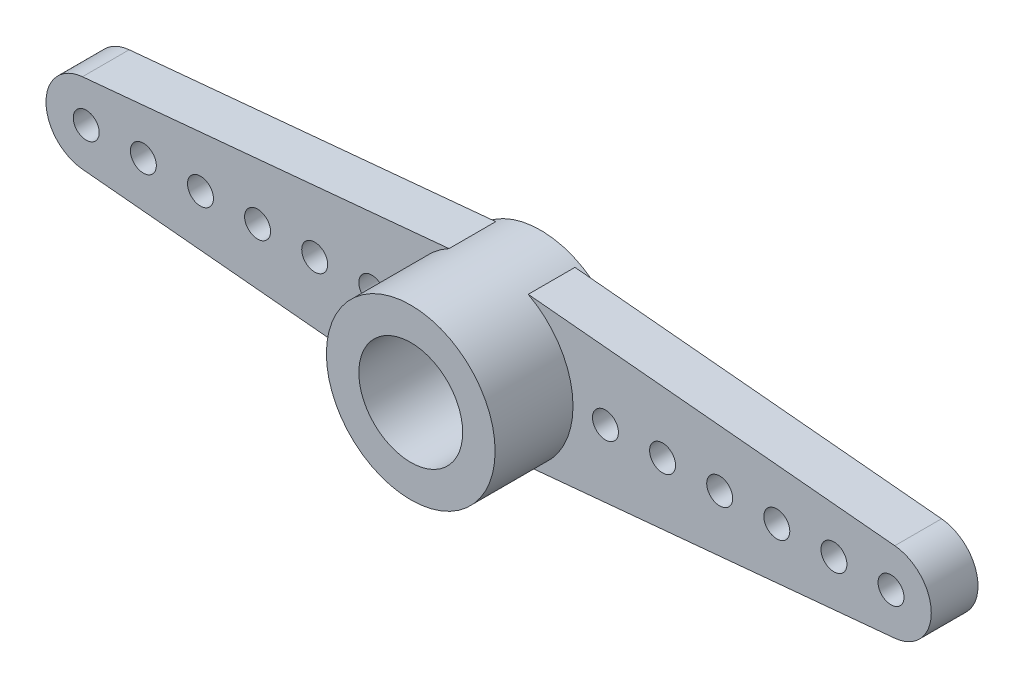
ISO-10303-21;
HEADER;
FILE_DESCRIPTION(('STEP AP214'),'2;1');
FILE_NAME('part.step','',(''),(''),'','','');
FILE_SCHEMA(('AUTOMOTIVE_DESIGN { 1 0 10303 214 1 1 1 1 }'));
ENDSEC;
DATA;
#1=APPLICATION_CONTEXT('core data for automotive mechanical design processes');
#2=APPLICATION_PROTOCOL_DEFINITION('international standard','automotive_design',2000,#1);
#3=PRODUCT_CONTEXT('',#1,'mechanical');
#4=PRODUCT('Part','Part','',(#3));
#5=PRODUCT_RELATED_PRODUCT_CATEGORY('part','',(#4));
#6=PRODUCT_DEFINITION_FORMATION('','',#4);
#7=PRODUCT_DEFINITION_CONTEXT('part definition',#1,'design');
#8=PRODUCT_DEFINITION('design','',#6,#7);
#9=PRODUCT_DEFINITION_SHAPE('','',#8);
#10=(LENGTH_UNIT() NAMED_UNIT(*) SI_UNIT(.MILLI.,.METRE.));
#11=(NAMED_UNIT(*) PLANE_ANGLE_UNIT() SI_UNIT($,.RADIAN.));
#12=(NAMED_UNIT(*) SI_UNIT($,.STERADIAN.) SOLID_ANGLE_UNIT());
#13=UNCERTAINTY_MEASURE_WITH_UNIT(LENGTH_MEASURE(1.E-05),#10,'distance_accuracy_value','');
#14=(GEOMETRIC_REPRESENTATION_CONTEXT(3) GLOBAL_UNCERTAINTY_ASSIGNED_CONTEXT((#13)) GLOBAL_UNIT_ASSIGNED_CONTEXT((#10,
#11,#12)) REPRESENTATION_CONTEXT('',''));
#15=CARTESIAN_POINT('',(0.,0.,0.));
#16=DIRECTION('',(0.,0.,1.));
#17=DIRECTION('',(1.,0.,0.));
#18=AXIS2_PLACEMENT_3D('',#15,#16,#17);
#19=CARTESIAN_POINT('',(15.5,0.,1.8));
#20=DIRECTION('',(0.,0.,1.));
#21=DIRECTION('',(1.,0.,0.));
#22=AXIS2_PLACEMENT_3D('',#19,#20,#21);
#23=PLANE('',#22);
#24=CARTESIAN_POINT('',(-15.5,0.,1.8));
#25=DIRECTION('',(0.,0.,1.));
#26=DIRECTION('',(1.,0.,0.));
#27=AXIS2_PLACEMENT_3D('',#24,#25,#26);
#28=CIRCLE('',#27,0.499999999999999);
#29=CARTESIAN_POINT('',(-15.,0.,1.8));
#30=VERTEX_POINT('',#29);
#31=EDGE_CURVE('E354',#30,#30,#28,.F.);
#32=ORIENTED_EDGE('',*,*,#31,.T.);
#33=EDGE_LOOP('',(#32));
#34=FACE_BOUND('',#33,.T.);
#35=CARTESIAN_POINT('',(-4.5,0.,1.8));
#36=DIRECTION('',(0.,0.,1.));
#37=DIRECTION('',(1.,0.,0.));
#38=AXIS2_PLACEMENT_3D('',#35,#36,#37);
#39=CIRCLE('',#38,0.499999999999999);
#40=CARTESIAN_POINT('',(-4.,0.,1.8));
#41=VERTEX_POINT('',#40);
#42=EDGE_CURVE('E371',#41,#41,#39,.F.);
#43=ORIENTED_EDGE('',*,*,#42,.T.);
#44=EDGE_LOOP('',(#43));
#45=FACE_BOUND('',#44,.T.);
#46=CARTESIAN_POINT('',(-6.7,0.,1.8));
#47=DIRECTION('',(0.,0.,1.));
#48=DIRECTION('',(1.,0.,0.));
#49=AXIS2_PLACEMENT_3D('',#46,#47,#48);
#50=CIRCLE('',#49,0.499999999999999);
#51=CARTESIAN_POINT('',(-6.2,0.,1.8));
#52=VERTEX_POINT('',#51);
#53=EDGE_CURVE('E365',#52,#52,#50,.F.);
#54=ORIENTED_EDGE('',*,*,#53,.T.);
#55=EDGE_LOOP('',(#54));
#56=FACE_BOUND('',#55,.T.);
#57=CARTESIAN_POINT('',(-13.3,0.,1.8));
#58=DIRECTION('',(0.,0.,1.));
#59=DIRECTION('',(1.,0.,0.));
#60=AXIS2_PLACEMENT_3D('',#57,#58,#59);
#61=CIRCLE('',#60,0.499999999999999);
#62=CARTESIAN_POINT('',(-12.8,0.,1.8));
#63=VERTEX_POINT('',#62);
#64=EDGE_CURVE('E386',#63,#63,#61,.F.);
#65=ORIENTED_EDGE('',*,*,#64,.T.);
#66=EDGE_LOOP('',(#65));
#67=FACE_BOUND('',#66,.T.);
#68=CARTESIAN_POINT('',(-11.1,0.,1.8));
#69=DIRECTION('',(0.,0.,1.));
#70=DIRECTION('',(1.,0.,0.));
#71=AXIS2_PLACEMENT_3D('',#68,#69,#70);
#72=CIRCLE('',#71,0.499999999999999);
#73=CARTESIAN_POINT('',(-10.6,0.,1.8));
#74=VERTEX_POINT('',#73);
#75=EDGE_CURVE('E387',#74,#74,#72,.F.);
#76=ORIENTED_EDGE('',*,*,#75,.T.);
#77=EDGE_LOOP('',(#76));
#78=FACE_BOUND('',#77,.T.);
#79=CARTESIAN_POINT('',(-8.9,0.,1.8));
#80=DIRECTION('',(0.,0.,1.));
#81=DIRECTION('',(1.,0.,0.));
#82=AXIS2_PLACEMENT_3D('',#79,#80,#81);
#83=CIRCLE('',#82,0.499999999999999);
#84=CARTESIAN_POINT('',(-8.4,0.,1.8));
#85=VERTEX_POINT('',#84);
#86=EDGE_CURVE('E364',#85,#85,#83,.F.);
#87=ORIENTED_EDGE('',*,*,#86,.T.);
#88=EDGE_LOOP('',(#87));
#89=FACE_BOUND('',#88,.T.);
#90=CARTESIAN_POINT('',(0.,0.,1.8));
#91=DIRECTION('',(0.,0.,1.));
#92=DIRECTION('',(1.,0.,0.));
#93=AXIS2_PLACEMENT_3D('',#90,#91,#92);
#94=CIRCLE('',#93,3.25);
#95=CARTESIAN_POINT('',(-1.52516357923835,2.8699087192043,1.8));
#96=VERTEX_POINT('',#95);
#97=CARTESIAN_POINT('',(-1.52516357923835,-2.8699087192043,1.8));
#98=VERTEX_POINT('',#97);
#99=EDGE_CURVE('E12',#96,#98,#94,.T.);
#100=ORIENTED_EDGE('',*,*,#99,.F.);
#101=DIRECTION('',(-0.995614734358422,-0.0935483870967741,0.));
#102=VECTOR('',#101,1.);
#103=CARTESIAN_POINT('',(-1.52516357923835,2.8699087192043,1.8));
#104=LINE('',#103,#102);
#105=CARTESIAN_POINT('',(-15.645,1.54320283825555,1.8));
#106=VERTEX_POINT('',#105);
#107=EDGE_CURVE('E146',#96,#106,#104,.T.);
#108=ORIENTED_EDGE('',*,*,#107,.T.);
#109=CARTESIAN_POINT('',(-15.5,0.,1.8));
#110=DIRECTION('',(0.,0.,1.));
#111=DIRECTION('',(-1.,0.,0.));
#112=AXIS2_PLACEMENT_3D('',#109,#110,#111);
#113=CIRCLE('',#112,1.55);
#114=CARTESIAN_POINT('',(-15.645,-1.54320283825555,1.8));
#115=VERTEX_POINT('',#114);
#116=EDGE_CURVE('E120',#106,#115,#113,.T.);
#117=ORIENTED_EDGE('',*,*,#116,.T.);
#118=DIRECTION('',(0.995614734358422,-0.0935483870967741,0.));
#119=VECTOR('',#118,1.);
#120=CARTESIAN_POINT('',(-1.52516357923835,-2.8699087192043,1.8));
#121=LINE('',#120,#119);
#122=EDGE_CURVE('E116',#115,#98,#121,.T.);
#123=ORIENTED_EDGE('',*,*,#122,.T.);
#124=EDGE_LOOP('',(#100,#108,#117,#123));
#125=FACE_BOUND('',#124,.T.);
#126=ADVANCED_FACE('F45',(#34,#45,#56,#67,#78,#89,#125),#23,.T.);
#127=CARTESIAN_POINT('',(15.5,0.,0.));
#128=DIRECTION('',(0.,0.,1.));
#129=DIRECTION('',(1.,0.,0.));
#130=AXIS2_PLACEMENT_3D('',#127,#128,#129);
#131=PLANE('',#130);
#132=CARTESIAN_POINT('',(8.9,0.,0.));
#133=DIRECTION('',(0.,0.,-1.));
#134=DIRECTION('',(1.,0.,0.));
#135=AXIS2_PLACEMENT_3D('',#132,#133,#134);
#136=CIRCLE('',#135,0.499999999999999);
#137=CARTESIAN_POINT('',(9.4,0.,0.));
#138=VERTEX_POINT('',#137);
#139=EDGE_CURVE('E378',#138,#138,#136,.T.);
#140=ORIENTED_EDGE('',*,*,#139,.F.);
#141=EDGE_LOOP('',(#140));
#142=FACE_BOUND('',#141,.T.);
#143=CARTESIAN_POINT('',(6.7,0.,0.));
#144=DIRECTION('',(0.,0.,-1.));
#145=DIRECTION('',(1.,0.,0.));
#146=AXIS2_PLACEMENT_3D('',#143,#144,#145);
#147=CIRCLE('',#146,0.499999999999999);
#148=CARTESIAN_POINT('',(7.2,0.,0.));
#149=VERTEX_POINT('',#148);
#150=EDGE_CURVE('E374',#149,#149,#147,.T.);
#151=ORIENTED_EDGE('',*,*,#150,.F.);
#152=EDGE_LOOP('',(#151));
#153=FACE_BOUND('',#152,.T.);
#154=CARTESIAN_POINT('',(4.5,0.,0.));
#155=DIRECTION('',(0.,0.,-1.));
#156=DIRECTION('',(1.,0.,0.));
#157=AXIS2_PLACEMENT_3D('',#154,#155,#156);
#158=CIRCLE('',#157,0.499999999999999);
#159=CARTESIAN_POINT('',(5.,0.,0.));
#160=VERTEX_POINT('',#159);
#161=EDGE_CURVE('E358',#160,#160,#158,.T.);
#162=ORIENTED_EDGE('',*,*,#161,.F.);
#163=EDGE_LOOP('',(#162));
#164=FACE_BOUND('',#163,.T.);
#165=CARTESIAN_POINT('',(11.1,0.,0.));
#166=DIRECTION('',(0.,0.,-1.));
#167=DIRECTION('',(1.,0.,0.));
#168=AXIS2_PLACEMENT_3D('',#165,#166,#167);
#169=CIRCLE('',#168,0.499999999999999);
#170=CARTESIAN_POINT('',(11.6,0.,0.));
#171=VERTEX_POINT('',#170);
#172=EDGE_CURVE('E382',#171,#171,#169,.T.);
#173=ORIENTED_EDGE('',*,*,#172,.F.);
#174=EDGE_LOOP('',(#173));
#175=FACE_BOUND('',#174,.T.);
#176=CARTESIAN_POINT('',(13.3,0.,0.));
#177=DIRECTION('',(0.,0.,-1.));
#178=DIRECTION('',(1.,0.,0.));
#179=AXIS2_PLACEMENT_3D('',#176,#177,#178);
#180=CIRCLE('',#179,0.499999999999999);
#181=CARTESIAN_POINT('',(13.8,0.,0.));
#182=VERTEX_POINT('',#181);
#183=EDGE_CURVE('E406',#182,#182,#180,.T.);
#184=ORIENTED_EDGE('',*,*,#183,.F.);
#185=EDGE_LOOP('',(#184));
#186=FACE_BOUND('',#185,.T.);
#187=CARTESIAN_POINT('',(15.5,0.,0.));
#188=DIRECTION('',(0.,0.,-1.));
#189=DIRECTION('',(1.,0.,0.));
#190=AXIS2_PLACEMENT_3D('',#187,#188,#189);
#191=CIRCLE('',#190,0.499999999999999);
#192=CARTESIAN_POINT('',(16.,0.,0.));
#193=VERTEX_POINT('',#192);
#194=EDGE_CURVE('E254',#193,#193,#191,.T.);
#195=ORIENTED_EDGE('',*,*,#194,.F.);
#196=EDGE_LOOP('',(#195));
#197=FACE_BOUND('',#196,.T.);
#198=CARTESIAN_POINT('',(0.,0.,0.));
#199=DIRECTION('',(0.,0.,-1.));
#200=DIRECTION('',(-1.,0.,0.));
#201=AXIS2_PLACEMENT_3D('',#198,#199,#200);
#202=CIRCLE('',#201,3.25);
#203=CARTESIAN_POINT('',(1.52516357923835,2.8699087192043,0.));
#204=VERTEX_POINT('',#203);
#205=CARTESIAN_POINT('',(1.52516357923835,-2.8699087192043,0.));
#206=VERTEX_POINT('',#205);
#207=EDGE_CURVE('E177',#204,#206,#202,.T.);
#208=ORIENTED_EDGE('',*,*,#207,.F.);
#209=DIRECTION('',(-0.995614734358422,0.0935483870967742,0.));
#210=VECTOR('',#209,1.);
#211=CARTESIAN_POINT('',(1.52516357923835,2.8699087192043,0.));
#212=LINE('',#211,#210);
#213=CARTESIAN_POINT('',(15.645,1.54320283825555,0.));
#214=VERTEX_POINT('',#213);
#215=EDGE_CURVE('E160',#214,#204,#212,.T.);
#216=ORIENTED_EDGE('',*,*,#215,.F.);
#217=CARTESIAN_POINT('',(15.5,0.,0.));
#218=DIRECTION('',(0.,0.,1.));
#219=DIRECTION('',(1.,0.,0.));
#220=AXIS2_PLACEMENT_3D('',#217,#218,#219);
#221=CIRCLE('',#220,1.55);
#222=CARTESIAN_POINT('',(15.645,-1.54320283825555,0.));
#223=VERTEX_POINT('',#222);
#224=EDGE_CURVE('E157',#223,#214,#221,.T.);
#225=ORIENTED_EDGE('',*,*,#224,.F.);
#226=DIRECTION('',(0.995614734358422,0.0935483870967742,0.));
#227=VECTOR('',#226,1.);
#228=CARTESIAN_POINT('',(1.52516357923835,-2.8699087192043,0.));
#229=LINE('',#228,#227);
#230=EDGE_CURVE('E93',#206,#223,#229,.T.);
#231=ORIENTED_EDGE('',*,*,#230,.F.);
#232=EDGE_LOOP('',(#208,#216,#225,#231));
#233=FACE_BOUND('',#232,.T.);
#234=ADVANCED_FACE('F187',(#142,#153,#164,#175,#186,#197,#233),#131,.F.);
#235=CARTESIAN_POINT('',(15.5,0.,1.8));
#236=DIRECTION('',(0.,0.,-1.));
#237=DIRECTION('',(-1.,0.,0.));
#238=AXIS2_PLACEMENT_3D('',#235,#236,#237);
#239=CYLINDRICAL_SURFACE('',#238,1.55);
#240=ORIENTED_EDGE('',*,*,#224,.T.);
#241=DIRECTION('',(0.,0.,-1.));
#242=VECTOR('',#241,1.);
#243=CARTESIAN_POINT('',(15.645,1.54320283825555,1.8));
#244=LINE('',#243,#242);
#245=CARTESIAN_POINT('',(15.645,1.54320283825555,1.8));
#246=VERTEX_POINT('',#245);
#247=EDGE_CURVE('E49',#246,#214,#244,.T.);
#248=ORIENTED_EDGE('',*,*,#247,.F.);
#249=CARTESIAN_POINT('',(15.5,0.,1.8));
#250=DIRECTION('',(0.,0.,1.));
#251=DIRECTION('',(1.,0.,0.));
#252=AXIS2_PLACEMENT_3D('',#249,#250,#251);
#253=CIRCLE('',#252,1.55);
#254=CARTESIAN_POINT('',(15.645,-1.54320283825555,1.8));
#255=VERTEX_POINT('',#254);
#256=EDGE_CURVE('E151',#255,#246,#253,.T.);
#257=ORIENTED_EDGE('',*,*,#256,.F.);
#258=DIRECTION('',(0.,0.,-1.));
#259=VECTOR('',#258,1.);
#260=CARTESIAN_POINT('',(15.645,-1.54320283825555,1.8));
#261=LINE('',#260,#259);
#262=EDGE_CURVE('E156',#255,#223,#261,.T.);
#263=ORIENTED_EDGE('',*,*,#262,.T.);
#264=EDGE_LOOP('',(#240,#248,#257,#263));
#265=FACE_BOUND('',#264,.T.);
#266=ADVANCED_FACE('F47',(#265),#239,.T.);
#267=CARTESIAN_POINT('',(1.52516357923835,2.8699087192043,1.8));
#268=DIRECTION('',(-0.0935483870967742,-0.995614734358422,0.));
#269=DIRECTION('',(0.995614734358423,-0.0935483870967742,0.));
#270=AXIS2_PLACEMENT_3D('',#267,#268,#269);
#271=PLANE('',#270);
#272=ORIENTED_EDGE('',*,*,#215,.T.);
#273=DIRECTION('',(0.,0.,-1.));
#274=VECTOR('',#273,1.);
#275=CARTESIAN_POINT('',(1.52516357923835,2.8699087192043,1.8));
#276=LINE('',#275,#274);
#277=CARTESIAN_POINT('',(1.52516357923835,2.8699087192043,1.8));
#278=VERTEX_POINT('',#277);
#279=EDGE_CURVE('E142',#278,#204,#276,.T.);
#280=ORIENTED_EDGE('',*,*,#279,.F.);
#281=DIRECTION('',(-0.995614734358422,0.0935483870967742,0.));
#282=VECTOR('',#281,1.);
#283=CARTESIAN_POINT('',(1.52516357923835,2.8699087192043,1.8));
#284=LINE('',#283,#282);
#285=EDGE_CURVE('E102',#246,#278,#284,.T.);
#286=ORIENTED_EDGE('',*,*,#285,.F.);
#287=ORIENTED_EDGE('',*,*,#247,.T.);
#288=EDGE_LOOP('',(#272,#280,#286,#287));
#289=FACE_BOUND('',#288,.T.);
#290=ADVANCED_FACE('F188',(#289),#271,.F.);
#291=CARTESIAN_POINT('',(-1.52516357923835,2.8699087192043,1.8));
#292=DIRECTION('',(0.0935483870967741,-0.995614734358422,0.));
#293=DIRECTION('',(0.995614734358423,0.0935483870967741,0.));
#294=AXIS2_PLACEMENT_3D('',#291,#292,#293);
#295=PLANE('',#294);
#296=DIRECTION('',(-0.995614734358422,-0.0935483870967741,0.));
#297=VECTOR('',#296,1.);
#298=CARTESIAN_POINT('',(-1.52516357923835,2.8699087192043,0.));
#299=LINE('',#298,#297);
#300=CARTESIAN_POINT('',(-1.52516357923836,2.8699087192043,0.));
#301=VERTEX_POINT('',#300);
#302=CARTESIAN_POINT('',(-15.645,1.54320283825555,0.));
#303=VERTEX_POINT('',#302);
#304=EDGE_CURVE('E164',#301,#303,#299,.T.);
#305=ORIENTED_EDGE('',*,*,#304,.T.);
#306=DIRECTION('',(0.,0.,-1.));
#307=VECTOR('',#306,1.);
#308=CARTESIAN_POINT('',(-15.645,1.54320283825555,1.8));
#309=LINE('',#308,#307);
#310=EDGE_CURVE('E143',#106,#303,#309,.T.);
#311=ORIENTED_EDGE('',*,*,#310,.F.);
#312=ORIENTED_EDGE('',*,*,#107,.F.);
#313=DIRECTION('',(0.,0.,-1.));
#314=VECTOR('',#313,1.);
#315=CARTESIAN_POINT('',(-1.52516357923835,2.8699087192043,1.8));
#316=LINE('',#315,#314);
#317=EDGE_CURVE('E138',#96,#301,#316,.T.);
#318=ORIENTED_EDGE('',*,*,#317,.T.);
#319=EDGE_LOOP('',(#305,#311,#312,#318));
#320=FACE_BOUND('',#319,.T.);
#321=ADVANCED_FACE('F147',(#320),#295,.F.);
#322=CARTESIAN_POINT('',(-15.5,0.,1.8));
#323=DIRECTION('',(0.,0.,-1.));
#324=DIRECTION('',(-1.,0.,0.));
#325=AXIS2_PLACEMENT_3D('',#322,#323,#324);
#326=CYLINDRICAL_SURFACE('',#325,1.55);
#327=CARTESIAN_POINT('',(-15.5,0.,0.));
#328=DIRECTION('',(0.,0.,1.));
#329=DIRECTION('',(-1.,0.,0.));
#330=AXIS2_PLACEMENT_3D('',#327,#328,#329);
#331=CIRCLE('',#330,1.55);
#332=CARTESIAN_POINT('',(-15.645,-1.54320283825555,0.));
#333=VERTEX_POINT('',#332);
#334=EDGE_CURVE('E166',#303,#333,#331,.T.);
#335=ORIENTED_EDGE('',*,*,#334,.T.);
#336=DIRECTION('',(0.,0.,-1.));
#337=VECTOR('',#336,1.);
#338=CARTESIAN_POINT('',(-15.645,-1.54320283825555,1.8));
#339=LINE('',#338,#337);
#340=EDGE_CURVE('E133',#115,#333,#339,.T.);
#341=ORIENTED_EDGE('',*,*,#340,.F.);
#342=ORIENTED_EDGE('',*,*,#116,.F.);
#343=ORIENTED_EDGE('',*,*,#310,.T.);
#344=EDGE_LOOP('',(#335,#341,#342,#343));
#345=FACE_BOUND('',#344,.T.);
#346=ADVANCED_FACE('F194',(#345),#326,.T.);
#347=CARTESIAN_POINT('',(-1.52516357923835,-2.8699087192043,1.8));
#348=DIRECTION('',(0.0935483870967741,0.995614734358422,0.));
#349=DIRECTION('',(-0.995614734358423,0.0935483870967741,0.));
#350=AXIS2_PLACEMENT_3D('',#347,#348,#349);
#351=PLANE('',#350);
#352=DIRECTION('',(0.995614734358422,-0.0935483870967741,0.));
#353=VECTOR('',#352,1.);
#354=CARTESIAN_POINT('',(-1.52516357923835,-2.8699087192043,0.));
#355=LINE('',#354,#353);
#356=CARTESIAN_POINT('',(-1.52516357923835,-2.8699087192043,0.));
#357=VERTEX_POINT('',#356);
#358=EDGE_CURVE('E130',#333,#357,#355,.T.);
#359=ORIENTED_EDGE('',*,*,#358,.T.);
#360=DIRECTION('',(0.,0.,-1.));
#361=VECTOR('',#360,1.);
#362=CARTESIAN_POINT('',(-1.52516357923835,-2.8699087192043,1.8));
#363=LINE('',#362,#361);
#364=EDGE_CURVE('E127',#98,#357,#363,.T.);
#365=ORIENTED_EDGE('',*,*,#364,.F.);
#366=ORIENTED_EDGE('',*,*,#122,.F.);
#367=ORIENTED_EDGE('',*,*,#340,.T.);
#368=EDGE_LOOP('',(#359,#365,#366,#367));
#369=FACE_BOUND('',#368,.T.);
#370=ADVANCED_FACE('F128',(#369),#351,.F.);
#371=CARTESIAN_POINT('',(0.,0.,1.8));
#372=DIRECTION('',(0.,0.,-1.));
#373=DIRECTION('',(-1.,0.,0.));
#374=AXIS2_PLACEMENT_3D('',#371,#372,#373);
#375=CYLINDRICAL_SURFACE('',#374,3.25);
#376=ORIENTED_EDGE('',*,*,#317,.F.);
#377=ORIENTED_EDGE('',*,*,#99,.T.);
#378=ORIENTED_EDGE('',*,*,#364,.T.);
#379=EDGE_CURVE('E140',#357,#301,#202,.T.);
#380=ORIENTED_EDGE('',*,*,#379,.T.);
#381=EDGE_LOOP('',(#376,#377,#378,#380));
#382=FACE_BOUND('',#381,.T.);
#383=CARTESIAN_POINT('',(1.52516357923835,-2.8699087192043,1.8));
#384=VERTEX_POINT('',#383);
#385=EDGE_CURVE('E55',#384,#278,#94,.T.);
#386=ORIENTED_EDGE('',*,*,#385,.T.);
#387=ORIENTED_EDGE('',*,*,#279,.T.);
#388=ORIENTED_EDGE('',*,*,#207,.T.);
#389=DIRECTION('',(0.,0.,-1.));
#390=VECTOR('',#389,1.);
#391=CARTESIAN_POINT('',(1.52516357923835,-2.8699087192043,1.8));
#392=LINE('',#391,#390);
#393=EDGE_CURVE('E90',#384,#206,#392,.T.);
#394=ORIENTED_EDGE('',*,*,#393,.F.);
#395=EDGE_LOOP('',(#386,#387,#388,#394));
#396=FACE_BOUND('',#395,.T.);
#397=CARTESIAN_POINT('',(0.,0.,-0.2));
#398=DIRECTION('',(0.,0.,-1.));
#399=DIRECTION('',(-1.,0.,0.));
#400=AXIS2_PLACEMENT_3D('',#397,#398,#399);
#401=CIRCLE('',#400,3.25);
#402=CARTESIAN_POINT('',(-3.25,0.,-0.2));
#403=VERTEX_POINT('',#402);
#404=EDGE_CURVE('E161',#403,#403,#401,.T.);
#405=ORIENTED_EDGE('',*,*,#404,.F.);
#406=EDGE_LOOP('',(#405));
#407=FACE_BOUND('',#406,.T.);
#408=CARTESIAN_POINT('',(0.,0.,4.8));
#409=DIRECTION('',(0.,0.,1.));
#410=DIRECTION('',(1.,0.,0.));
#411=AXIS2_PLACEMENT_3D('',#408,#409,#410);
#412=CIRCLE('',#411,3.25);
#413=CARTESIAN_POINT('',(3.25,0.,4.8));
#414=VERTEX_POINT('',#413);
#415=EDGE_CURVE('E271',#414,#414,#412,.T.);
#416=ORIENTED_EDGE('',*,*,#415,.F.);
#417=EDGE_LOOP('',(#416));
#418=FACE_BOUND('',#417,.T.);
#419=ADVANCED_FACE('F135',(#382,#396,#407,#418),#375,.T.);
#420=CARTESIAN_POINT('',(1.52516357923835,-2.8699087192043,1.8));
#421=DIRECTION('',(-0.0935483870967742,0.995614734358422,0.));
#422=DIRECTION('',(-0.995614734358423,-0.0935483870967742,0.));
#423=AXIS2_PLACEMENT_3D('',#420,#421,#422);
#424=PLANE('',#423);
#425=ORIENTED_EDGE('',*,*,#230,.T.);
#426=ORIENTED_EDGE('',*,*,#262,.F.);
#427=DIRECTION('',(0.995614734358422,0.0935483870967742,0.));
#428=VECTOR('',#427,1.);
#429=CARTESIAN_POINT('',(1.52516357923835,-2.8699087192043,1.8));
#430=LINE('',#429,#428);
#431=EDGE_CURVE('E64',#384,#255,#430,.T.);
#432=ORIENTED_EDGE('',*,*,#431,.F.);
#433=ORIENTED_EDGE('',*,*,#393,.T.);
#434=EDGE_LOOP('',(#425,#426,#432,#433));
#435=FACE_BOUND('',#434,.T.);
#436=ADVANCED_FACE('F221',(#435),#424,.F.);
#437=CARTESIAN_POINT('',(8.9,0.,1.8));
#438=DIRECTION('',(0.,0.,1.));
#439=DIRECTION('',(1.,0.,0.));
#440=AXIS2_PLACEMENT_3D('',#437,#438,#439);
#441=CIRCLE('',#440,0.499999999999999);
#442=CARTESIAN_POINT('',(9.4,0.,1.8));
#443=VERTEX_POINT('',#442);
#444=EDGE_CURVE('E233',#443,#443,#441,.F.);
#445=ORIENTED_EDGE('',*,*,#444,.T.);
#446=EDGE_LOOP('',(#445));
#447=FACE_BOUND('',#446,.T.);
#448=CARTESIAN_POINT('',(6.7,0.,1.8));
#449=DIRECTION('',(0.,0.,1.));
#450=DIRECTION('',(1.,0.,0.));
#451=AXIS2_PLACEMENT_3D('',#448,#449,#450);
#452=CIRCLE('',#451,0.499999999999999);
#453=CARTESIAN_POINT('',(7.2,0.,1.8));
#454=VERTEX_POINT('',#453);
#455=EDGE_CURVE('E237',#454,#454,#452,.F.);
#456=ORIENTED_EDGE('',*,*,#455,.T.);
#457=EDGE_LOOP('',(#456));
#458=FACE_BOUND('',#457,.T.);
#459=CARTESIAN_POINT('',(4.5,0.,1.8));
#460=DIRECTION('',(0.,0.,1.));
#461=DIRECTION('',(1.,0.,0.));
#462=AXIS2_PLACEMENT_3D('',#459,#460,#461);
#463=CIRCLE('',#462,0.499999999999999);
#464=CARTESIAN_POINT('',(5.,0.,1.8));
#465=VERTEX_POINT('',#464);
#466=EDGE_CURVE('E241',#465,#465,#463,.F.);
#467=ORIENTED_EDGE('',*,*,#466,.T.);
#468=EDGE_LOOP('',(#467));
#469=FACE_BOUND('',#468,.T.);
#470=CARTESIAN_POINT('',(11.1,0.,1.8));
#471=DIRECTION('',(0.,0.,1.));
#472=DIRECTION('',(1.,0.,0.));
#473=AXIS2_PLACEMENT_3D('',#470,#471,#472);
#474=CIRCLE('',#473,0.499999999999999);
#475=CARTESIAN_POINT('',(11.6,0.,1.8));
#476=VERTEX_POINT('',#475);
#477=EDGE_CURVE('E245',#476,#476,#474,.F.);
#478=ORIENTED_EDGE('',*,*,#477,.T.);
#479=EDGE_LOOP('',(#478));
#480=FACE_BOUND('',#479,.T.);
#481=CARTESIAN_POINT('',(13.3,0.,1.8));
#482=DIRECTION('',(0.,0.,1.));
#483=DIRECTION('',(1.,0.,0.));
#484=AXIS2_PLACEMENT_3D('',#481,#482,#483);
#485=CIRCLE('',#484,0.499999999999999);
#486=CARTESIAN_POINT('',(13.8,0.,1.8));
#487=VERTEX_POINT('',#486);
#488=EDGE_CURVE('E249',#487,#487,#485,.F.);
#489=ORIENTED_EDGE('',*,*,#488,.T.);
#490=EDGE_LOOP('',(#489));
#491=FACE_BOUND('',#490,.T.);
#492=CARTESIAN_POINT('',(15.5,0.,1.8));
#493=DIRECTION('',(0.,0.,1.));
#494=DIRECTION('',(1.,0.,0.));
#495=AXIS2_PLACEMENT_3D('',#492,#493,#494);
#496=CIRCLE('',#495,0.499999999999999);
#497=CARTESIAN_POINT('',(16.,0.,1.8));
#498=VERTEX_POINT('',#497);
#499=EDGE_CURVE('E252',#498,#498,#496,.F.);
#500=ORIENTED_EDGE('',*,*,#499,.T.);
#501=EDGE_LOOP('',(#500));
#502=FACE_BOUND('',#501,.T.);
#503=ORIENTED_EDGE('',*,*,#385,.F.);
#504=ORIENTED_EDGE('',*,*,#431,.T.);
#505=ORIENTED_EDGE('',*,*,#256,.T.);
#506=ORIENTED_EDGE('',*,*,#285,.T.);
#507=EDGE_LOOP('',(#503,#504,#505,#506));
#508=FACE_BOUND('',#507,.T.);
#509=ADVANCED_FACE('F182',(#447,#458,#469,#480,#491,#502,#508),#23,.T.);
#510=CARTESIAN_POINT('',(-15.5,0.,0.));
#511=DIRECTION('',(0.,0.,-1.));
#512=DIRECTION('',(-1.,0.,0.));
#513=AXIS2_PLACEMENT_3D('',#510,#511,#512);
#514=CIRCLE('',#513,0.499999999999999);
#515=CARTESIAN_POINT('',(-16.,0.,0.));
#516=VERTEX_POINT('',#515);
#517=EDGE_CURVE('E264',#516,#516,#514,.T.);
#518=ORIENTED_EDGE('',*,*,#517,.F.);
#519=EDGE_LOOP('',(#518));
#520=FACE_BOUND('',#519,.T.);
#521=CARTESIAN_POINT('',(-4.5,0.,0.));
#522=DIRECTION('',(0.,0.,-1.));
#523=DIRECTION('',(-1.,0.,0.));
#524=AXIS2_PLACEMENT_3D('',#521,#522,#523);
#525=CIRCLE('',#524,0.499999999999999);
#526=CARTESIAN_POINT('',(-5.,0.,0.));
#527=VERTEX_POINT('',#526);
#528=EDGE_CURVE('E368',#527,#527,#525,.T.);
#529=ORIENTED_EDGE('',*,*,#528,.F.);
#530=EDGE_LOOP('',(#529));
#531=FACE_BOUND('',#530,.T.);
#532=CARTESIAN_POINT('',(-6.7,0.,0.));
#533=DIRECTION('',(0.,0.,-1.));
#534=DIRECTION('',(-1.,0.,0.));
#535=AXIS2_PLACEMENT_3D('',#532,#533,#534);
#536=CIRCLE('',#535,0.499999999999999);
#537=CARTESIAN_POINT('',(-7.2,0.,0.));
#538=VERTEX_POINT('',#537);
#539=EDGE_CURVE('E361',#538,#538,#536,.T.);
#540=ORIENTED_EDGE('',*,*,#539,.F.);
#541=EDGE_LOOP('',(#540));
#542=FACE_BOUND('',#541,.T.);
#543=CARTESIAN_POINT('',(-13.3,0.,0.));
#544=DIRECTION('',(0.,0.,-1.));
#545=DIRECTION('',(-1.,0.,0.));
#546=AXIS2_PLACEMENT_3D('',#543,#544,#545);
#547=CIRCLE('',#546,0.499999999999999);
#548=CARTESIAN_POINT('',(-13.8,0.,0.));
#549=VERTEX_POINT('',#548);
#550=EDGE_CURVE('E398',#549,#549,#547,.T.);
#551=ORIENTED_EDGE('',*,*,#550,.F.);
#552=EDGE_LOOP('',(#551));
#553=FACE_BOUND('',#552,.T.);
#554=CARTESIAN_POINT('',(-11.1,0.,0.));
#555=DIRECTION('',(0.,0.,-1.));
#556=DIRECTION('',(-1.,0.,0.));
#557=AXIS2_PLACEMENT_3D('',#554,#555,#556);
#558=CIRCLE('',#557,0.499999999999999);
#559=CARTESIAN_POINT('',(-11.6,0.,0.));
#560=VERTEX_POINT('',#559);
#561=EDGE_CURVE('E383',#560,#560,#558,.T.);
#562=ORIENTED_EDGE('',*,*,#561,.F.);
#563=EDGE_LOOP('',(#562));
#564=FACE_BOUND('',#563,.T.);
#565=CARTESIAN_POINT('',(-8.9,0.,0.));
#566=DIRECTION('',(0.,0.,-1.));
#567=DIRECTION('',(-1.,0.,0.));
#568=AXIS2_PLACEMENT_3D('',#565,#566,#567);
#569=CIRCLE('',#568,0.499999999999999);
#570=CARTESIAN_POINT('',(-9.4,0.,0.));
#571=VERTEX_POINT('',#570);
#572=EDGE_CURVE('E390',#571,#571,#569,.T.);
#573=ORIENTED_EDGE('',*,*,#572,.F.);
#574=EDGE_LOOP('',(#573));
#575=FACE_BOUND('',#574,.T.);
#576=ORIENTED_EDGE('',*,*,#379,.F.);
#577=ORIENTED_EDGE('',*,*,#358,.F.);
#578=ORIENTED_EDGE('',*,*,#334,.F.);
#579=ORIENTED_EDGE('',*,*,#304,.F.);
#580=EDGE_LOOP('',(#576,#577,#578,#579));
#581=FACE_BOUND('',#580,.T.);
#582=ADVANCED_FACE('F192',(#520,#531,#542,#553,#564,#575,#581),#131,.F.);
#583=CARTESIAN_POINT('',(0.,0.,-0.2));
#584=DIRECTION('',(0.,0.,-1.));
#585=DIRECTION('',(-1.,0.,0.));
#586=AXIS2_PLACEMENT_3D('',#583,#584,#585);
#587=PLANE('',#586);
#588=ORIENTED_EDGE('',*,*,#404,.T.);
#589=EDGE_LOOP('',(#588));
#590=FACE_BOUND('',#589,.T.);
#591=CARTESIAN_POINT('',(0.,0.,-0.2));
#592=DIRECTION('',(0.,0.,-1.));
#593=DIRECTION('',(-1.,0.,0.));
#594=AXIS2_PLACEMENT_3D('',#591,#592,#593);
#595=CIRCLE('',#594,2.5);
#596=CARTESIAN_POINT('',(-2.5,0.,-0.2));
#597=VERTEX_POINT('',#596);
#598=EDGE_CURVE('E277',#597,#597,#595,.T.);
#599=ORIENTED_EDGE('',*,*,#598,.F.);
#600=EDGE_LOOP('',(#599));
#601=FACE_BOUND('',#600,.T.);
#602=ADVANCED_FACE('F227',(#590,#601),#587,.T.);
#603=CARTESIAN_POINT('',(0.,0.,-0.2));
#604=DIRECTION('',(0.,0.,1.));
#605=DIRECTION('',(1.,0.,0.));
#606=AXIS2_PLACEMENT_3D('',#603,#604,#605);
#607=CYLINDRICAL_SURFACE('',#606,2.5);
#608=ORIENTED_EDGE('',*,*,#598,.T.);
#609=EDGE_LOOP('',(#608));
#610=FACE_BOUND('',#609,.T.);
#611=CARTESIAN_POINT('',(0.,0.,0.));
#612=DIRECTION('',(0.,0.,-1.));
#613=DIRECTION('',(-1.,0.,0.));
#614=AXIS2_PLACEMENT_3D('',#611,#612,#613);
#615=CIRCLE('',#614,2.5);
#616=CARTESIAN_POINT('',(-2.5,0.,0.));
#617=VERTEX_POINT('',#616);
#618=EDGE_CURVE('E275',#617,#617,#615,.T.);
#619=ORIENTED_EDGE('',*,*,#618,.F.);
#620=EDGE_LOOP('',(#619));
#621=FACE_BOUND('',#620,.T.);
#622=ADVANCED_FACE('F283',(#610,#621),#607,.F.);
#623=CARTESIAN_POINT('',(0.,0.,0.));
#624=DIRECTION('',(0.,0.,1.));
#625=DIRECTION('',(1.,0.,0.));
#626=AXIS2_PLACEMENT_3D('',#623,#624,#625);
#627=CIRCLE('',#626,1.5);
#628=CARTESIAN_POINT('',(1.5,0.,0.));
#629=VERTEX_POINT('',#628);
#630=EDGE_CURVE('E263',#629,#629,#627,.F.);
#631=ORIENTED_EDGE('',*,*,#630,.F.);
#632=EDGE_LOOP('',(#631));
#633=FACE_BOUND('',#632,.T.);
#634=ORIENTED_EDGE('',*,*,#618,.T.);
#635=EDGE_LOOP('',(#634));
#636=FACE_BOUND('',#635,.T.);
#637=ADVANCED_FACE('F212',(#633,#636),#131,.F.);
#638=CARTESIAN_POINT('',(0.,0.,4.8));
#639=DIRECTION('',(0.,0.,1.));
#640=DIRECTION('',(1.,0.,0.));
#641=AXIS2_PLACEMENT_3D('',#638,#639,#640);
#642=PLANE('',#641);
#643=ORIENTED_EDGE('',*,*,#415,.T.);
#644=EDGE_LOOP('',(#643));
#645=FACE_BOUND('',#644,.T.);
#646=CARTESIAN_POINT('',(0.,0.,4.8));
#647=DIRECTION('',(0.,0.,1.));
#648=DIRECTION('',(1.,0.,0.));
#649=AXIS2_PLACEMENT_3D('',#646,#647,#648);
#650=CIRCLE('',#649,2.);
#651=CARTESIAN_POINT('',(2.,0.,4.8));
#652=VERTEX_POINT('',#651);
#653=EDGE_CURVE('E268',#652,#652,#650,.T.);
#654=ORIENTED_EDGE('',*,*,#653,.F.);
#655=EDGE_LOOP('',(#654));
#656=FACE_BOUND('',#655,.T.);
#657=ADVANCED_FACE('F291',(#645,#656),#642,.T.);
#658=CARTESIAN_POINT('',(0.,0.,4.8));
#659=DIRECTION('',(0.,0.,-1.));
#660=DIRECTION('',(-1.,0.,0.));
#661=AXIS2_PLACEMENT_3D('',#658,#659,#660);
#662=CYLINDRICAL_SURFACE('',#661,2.);
#663=ORIENTED_EDGE('',*,*,#653,.T.);
#664=EDGE_LOOP('',(#663));
#665=FACE_BOUND('',#664,.T.);
#666=CARTESIAN_POINT('',(0.,0.,1.8));
#667=DIRECTION('',(0.,0.,1.));
#668=DIRECTION('',(1.,0.,0.));
#669=AXIS2_PLACEMENT_3D('',#666,#667,#668);
#670=CIRCLE('',#669,2.);
#671=CARTESIAN_POINT('',(2.,0.,1.8));
#672=VERTEX_POINT('',#671);
#673=EDGE_CURVE('E267',#672,#672,#670,.T.);
#674=ORIENTED_EDGE('',*,*,#673,.F.);
#675=EDGE_LOOP('',(#674));
#676=FACE_BOUND('',#675,.T.);
#677=ADVANCED_FACE('F218',(#665,#676),#662,.F.);
#678=CARTESIAN_POINT('',(0.,0.,1.8));
#679=DIRECTION('',(0.,0.,1.));
#680=DIRECTION('',(1.,0.,0.));
#681=AXIS2_PLACEMENT_3D('',#678,#679,#680);
#682=CIRCLE('',#681,1.5);
#683=CARTESIAN_POINT('',(1.5,0.,1.8));
#684=VERTEX_POINT('',#683);
#685=EDGE_CURVE('E260',#684,#684,#682,.T.);
#686=ORIENTED_EDGE('',*,*,#685,.F.);
#687=EDGE_LOOP('',(#686));
#688=FACE_BOUND('',#687,.T.);
#689=ORIENTED_EDGE('',*,*,#673,.T.);
#690=EDGE_LOOP('',(#689));
#691=FACE_BOUND('',#690,.T.);
#692=ADVANCED_FACE('F206',(#688,#691),#23,.T.);
#693=CARTESIAN_POINT('',(0.,0.,-0.201));
#694=DIRECTION('',(0.,0.,1.));
#695=DIRECTION('',(1.,0.,0.));
#696=AXIS2_PLACEMENT_3D('',#693,#694,#695);
#697=CYLINDRICAL_SURFACE('',#696,1.5);
#698=ORIENTED_EDGE('',*,*,#685,.T.);
#699=EDGE_LOOP('',(#698));
#700=FACE_BOUND('',#699,.T.);
#701=ORIENTED_EDGE('',*,*,#630,.T.);
#702=EDGE_LOOP('',(#701));
#703=FACE_BOUND('',#702,.T.);
#704=ADVANCED_FACE('F217',(#700,#703),#697,.F.);
#705=CARTESIAN_POINT('',(-8.9,0.,4.801));
#706=DIRECTION('',(0.,0.,-1.));
#707=DIRECTION('',(-1.,0.,0.));
#708=AXIS2_PLACEMENT_3D('',#705,#706,#707);
#709=CYLINDRICAL_SURFACE('',#708,0.499999999999999);
#710=ORIENTED_EDGE('',*,*,#86,.F.);
#711=EDGE_LOOP('',(#710));
#712=FACE_BOUND('',#711,.T.);
#713=ORIENTED_EDGE('',*,*,#572,.T.);
#714=EDGE_LOOP('',(#713));
#715=FACE_BOUND('',#714,.T.);
#716=ADVANCED_FACE('F303',(#712,#715),#709,.F.);
#717=CARTESIAN_POINT('',(-11.1,0.,4.801));
#718=DIRECTION('',(0.,0.,-1.));
#719=DIRECTION('',(-1.,0.,0.));
#720=AXIS2_PLACEMENT_3D('',#717,#718,#719);
#721=CYLINDRICAL_SURFACE('',#720,0.499999999999999);
#722=ORIENTED_EDGE('',*,*,#75,.F.);
#723=EDGE_LOOP('',(#722));
#724=FACE_BOUND('',#723,.T.);
#725=ORIENTED_EDGE('',*,*,#561,.T.);
#726=EDGE_LOOP('',(#725));
#727=FACE_BOUND('',#726,.T.);
#728=ADVANCED_FACE('F322',(#724,#727),#721,.F.);
#729=CARTESIAN_POINT('',(-13.3,0.,4.801));
#730=DIRECTION('',(0.,0.,-1.));
#731=DIRECTION('',(-1.,0.,0.));
#732=AXIS2_PLACEMENT_3D('',#729,#730,#731);
#733=CYLINDRICAL_SURFACE('',#732,0.499999999999999);
#734=ORIENTED_EDGE('',*,*,#64,.F.);
#735=EDGE_LOOP('',(#734));
#736=FACE_BOUND('',#735,.T.);
#737=ORIENTED_EDGE('',*,*,#550,.T.);
#738=EDGE_LOOP('',(#737));
#739=FACE_BOUND('',#738,.T.);
#740=ADVANCED_FACE('F318',(#736,#739),#733,.F.);
#741=CARTESIAN_POINT('',(-6.7,0.,4.801));
#742=DIRECTION('',(0.,0.,-1.));
#743=DIRECTION('',(-1.,0.,0.));
#744=AXIS2_PLACEMENT_3D('',#741,#742,#743);
#745=CYLINDRICAL_SURFACE('',#744,0.499999999999999);
#746=ORIENTED_EDGE('',*,*,#53,.F.);
#747=EDGE_LOOP('',(#746));
#748=FACE_BOUND('',#747,.T.);
#749=ORIENTED_EDGE('',*,*,#539,.T.);
#750=EDGE_LOOP('',(#749));
#751=FACE_BOUND('',#750,.T.);
#752=ADVANCED_FACE('F321',(#748,#751),#745,.F.);
#753=CARTESIAN_POINT('',(-4.5,0.,4.801));
#754=DIRECTION('',(0.,0.,-1.));
#755=DIRECTION('',(-1.,0.,0.));
#756=AXIS2_PLACEMENT_3D('',#753,#754,#755);
#757=CYLINDRICAL_SURFACE('',#756,0.499999999999999);
#758=ORIENTED_EDGE('',*,*,#42,.F.);
#759=EDGE_LOOP('',(#758));
#760=FACE_BOUND('',#759,.T.);
#761=ORIENTED_EDGE('',*,*,#528,.T.);
#762=EDGE_LOOP('',(#761));
#763=FACE_BOUND('',#762,.T.);
#764=ADVANCED_FACE('F341',(#760,#763),#757,.F.);
#765=CARTESIAN_POINT('',(-15.5,0.,4.801));
#766=DIRECTION('',(0.,0.,-1.));
#767=DIRECTION('',(-1.,0.,0.));
#768=AXIS2_PLACEMENT_3D('',#765,#766,#767);
#769=CYLINDRICAL_SURFACE('',#768,0.499999999999999);
#770=ORIENTED_EDGE('',*,*,#31,.F.);
#771=EDGE_LOOP('',(#770));
#772=FACE_BOUND('',#771,.T.);
#773=ORIENTED_EDGE('',*,*,#517,.T.);
#774=EDGE_LOOP('',(#773));
#775=FACE_BOUND('',#774,.T.);
#776=ADVANCED_FACE('F309',(#772,#775),#769,.F.);
#777=CARTESIAN_POINT('',(15.5,0.,4.801));
#778=DIRECTION('',(0.,0.,-1.));
#779=DIRECTION('',(-1.,0.,0.));
#780=AXIS2_PLACEMENT_3D('',#777,#778,#779);
#781=CYLINDRICAL_SURFACE('',#780,0.499999999999999);
#782=ORIENTED_EDGE('',*,*,#499,.F.);
#783=EDGE_LOOP('',(#782));
#784=FACE_BOUND('',#783,.T.);
#785=ORIENTED_EDGE('',*,*,#194,.T.);
#786=EDGE_LOOP('',(#785));
#787=FACE_BOUND('',#786,.T.);
#788=ADVANCED_FACE('F305',(#784,#787),#781,.F.);
#789=CARTESIAN_POINT('',(13.3,0.,4.801));
#790=DIRECTION('',(0.,0.,-1.));
#791=DIRECTION('',(-1.,0.,0.));
#792=AXIS2_PLACEMENT_3D('',#789,#790,#791);
#793=CYLINDRICAL_SURFACE('',#792,0.499999999999999);
#794=ORIENTED_EDGE('',*,*,#488,.F.);
#795=EDGE_LOOP('',(#794));
#796=FACE_BOUND('',#795,.T.);
#797=ORIENTED_EDGE('',*,*,#183,.T.);
#798=EDGE_LOOP('',(#797));
#799=FACE_BOUND('',#798,.T.);
#800=ADVANCED_FACE('F308',(#796,#799),#793,.F.);
#801=CARTESIAN_POINT('',(11.1,0.,4.801));
#802=DIRECTION('',(0.,0.,-1.));
#803=DIRECTION('',(-1.,0.,0.));
#804=AXIS2_PLACEMENT_3D('',#801,#802,#803);
#805=CYLINDRICAL_SURFACE('',#804,0.499999999999999);
#806=ORIENTED_EDGE('',*,*,#477,.F.);
#807=EDGE_LOOP('',(#806));
#808=FACE_BOUND('',#807,.T.);
#809=ORIENTED_EDGE('',*,*,#172,.T.);
#810=EDGE_LOOP('',(#809));
#811=FACE_BOUND('',#810,.T.);
#812=ADVANCED_FACE('F312',(#808,#811),#805,.F.);
#813=CARTESIAN_POINT('',(4.5,0.,4.801));
#814=DIRECTION('',(0.,0.,-1.));
#815=DIRECTION('',(-1.,0.,0.));
#816=AXIS2_PLACEMENT_3D('',#813,#814,#815);
#817=CYLINDRICAL_SURFACE('',#816,0.499999999999999);
#818=ORIENTED_EDGE('',*,*,#466,.F.);
#819=EDGE_LOOP('',(#818));
#820=FACE_BOUND('',#819,.T.);
#821=ORIENTED_EDGE('',*,*,#161,.T.);
#822=EDGE_LOOP('',(#821));
#823=FACE_BOUND('',#822,.T.);
#824=ADVANCED_FACE('F316',(#820,#823),#817,.F.);
#825=CARTESIAN_POINT('',(6.7,0.,4.801));
#826=DIRECTION('',(0.,0.,-1.));
#827=DIRECTION('',(-1.,0.,0.));
#828=AXIS2_PLACEMENT_3D('',#825,#826,#827);
#829=CYLINDRICAL_SURFACE('',#828,0.499999999999999);
#830=ORIENTED_EDGE('',*,*,#455,.F.);
#831=EDGE_LOOP('',(#830));
#832=FACE_BOUND('',#831,.T.);
#833=ORIENTED_EDGE('',*,*,#150,.T.);
#834=EDGE_LOOP('',(#833));
#835=FACE_BOUND('',#834,.T.);
#836=ADVANCED_FACE('F326',(#832,#835),#829,.F.);
#837=CARTESIAN_POINT('',(8.9,0.,4.801));
#838=DIRECTION('',(0.,0.,-1.));
#839=DIRECTION('',(-1.,0.,0.));
#840=AXIS2_PLACEMENT_3D('',#837,#838,#839);
#841=CYLINDRICAL_SURFACE('',#840,0.499999999999999);
#842=ORIENTED_EDGE('',*,*,#444,.F.);
#843=EDGE_LOOP('',(#842));
#844=FACE_BOUND('',#843,.T.);
#845=ORIENTED_EDGE('',*,*,#139,.T.);
#846=EDGE_LOOP('',(#845));
#847=FACE_BOUND('',#846,.T.);
#848=ADVANCED_FACE('F334',(#844,#847),#841,.F.);
#849=CLOSED_SHELL('',(#126,#234,#266,#290,#321,#346,#370,#419,#436,#509,#582,#602,#622,#637,
#657,#677,#692,#704,#716,#728,#740,#752,#764,#776,#788,#800,#812,#824,#836,#848));
#850=MANIFOLD_SOLID_BREP('B2',#849);
#851=ADVANCED_BREP_SHAPE_REPRESENTATION('',(#18,#850),#14);
#852=SHAPE_DEFINITION_REPRESENTATION(#9,#851);
ENDSEC;
END-ISO-10303-21;
